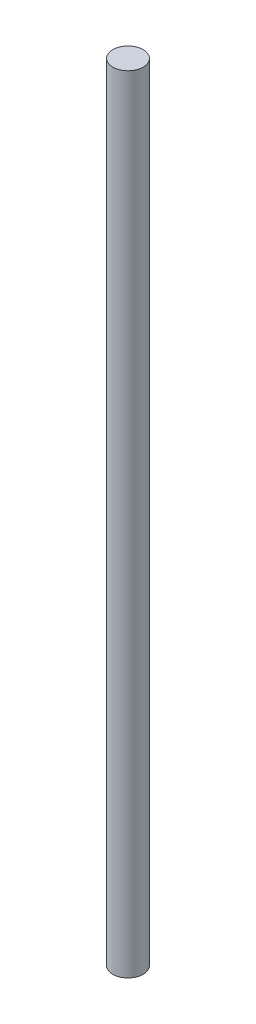
ISO-10303-21;
HEADER;
FILE_DESCRIPTION(('STEP AP214'),'2;1');
FILE_NAME('part.step','',(''),(''),'','','');
FILE_SCHEMA(('AUTOMOTIVE_DESIGN { 1 0 10303 214 1 1 1 1 }'));
ENDSEC;
DATA;
#1=APPLICATION_CONTEXT('core data for automotive mechanical design processes');
#2=APPLICATION_PROTOCOL_DEFINITION('international standard','automotive_design',2000,#1);
#3=PRODUCT_CONTEXT('',#1,'mechanical');
#4=PRODUCT('Part','Part','',(#3));
#5=PRODUCT_RELATED_PRODUCT_CATEGORY('part','',(#4));
#6=PRODUCT_DEFINITION_FORMATION('','',#4);
#7=PRODUCT_DEFINITION_CONTEXT('part definition',#1,'design');
#8=PRODUCT_DEFINITION('design','',#6,#7);
#9=PRODUCT_DEFINITION_SHAPE('','',#8);
#10=(LENGTH_UNIT() NAMED_UNIT(*) SI_UNIT(.MILLI.,.METRE.));
#11=(NAMED_UNIT(*) PLANE_ANGLE_UNIT() SI_UNIT($,.RADIAN.));
#12=(NAMED_UNIT(*) SI_UNIT($,.STERADIAN.) SOLID_ANGLE_UNIT());
#13=UNCERTAINTY_MEASURE_WITH_UNIT(LENGTH_MEASURE(1.E-05),#10,'distance_accuracy_value','');
#14=(GEOMETRIC_REPRESENTATION_CONTEXT(3) GLOBAL_UNCERTAINTY_ASSIGNED_CONTEXT((#13)) GLOBAL_UNIT_ASSIGNED_CONTEXT((#10,
#11,#12)) REPRESENTATION_CONTEXT('',''));
#15=CARTESIAN_POINT('',(0.,0.,0.));
#16=DIRECTION('',(0.,0.,1.));
#17=DIRECTION('',(1.,0.,0.));
#18=AXIS2_PLACEMENT_3D('',#15,#16,#17);
#19=CARTESIAN_POINT('',(10.6802952823821,-109.655613693188,5.86527124349379));
#20=DIRECTION('',(0.,-1.,0.));
#21=DIRECTION('',(-0.48135842784927,0.,0.876523852464084));
#22=AXIS2_PLACEMENT_3D('',#19,#20,#21);
#23=PLANE('',#22);
#24=CARTESIAN_POINT('',(0.,-109.655613693188,0.));
#25=DIRECTION('',(0.,-1.,0.));
#26=DIRECTION('',(0.,0.,-1.));
#27=AXIS2_PLACEMENT_3D('',#24,#25,#26);
#28=CIRCLE('',#27,2.33271488157282);
#29=CARTESIAN_POINT('',(0.,-109.655613693188,-2.33271488157282));
#30=VERTEX_POINT('',#29);
#31=EDGE_CURVE('E10',#30,#30,#28,.F.);
#32=ORIENTED_EDGE('',*,*,#31,.F.);
#33=EDGE_LOOP('',(#32));
#34=FACE_BOUND('',#33,.T.);
#35=ADVANCED_FACE('F32',(#34),#23,.T.);
#36=CARTESIAN_POINT('',(0.,-116.253527738527,0.));
#37=DIRECTION('',(0.,1.,0.));
#38=DIRECTION('',(0.,0.,1.));
#39=AXIS2_PLACEMENT_3D('',#36,#37,#38);
#40=CYLINDRICAL_SURFACE('',#39,2.33271488157282);
#41=ORIENTED_EDGE('',*,*,#31,.T.);
#42=EDGE_LOOP('',(#41));
#43=FACE_BOUND('',#42,.T.);
#44=CARTESIAN_POINT('',(-1.53523027623947E-13,11.0000000000004,4.1286418728248E-13));
#45=DIRECTION('',(0.,-1.,0.));
#46=DIRECTION('',(0.48135842784927,0.,-0.876523852464083));
#47=AXIS2_PLACEMENT_3D('',#44,#45,#46);
#48=CIRCLE('',#47,2.33271488157284);
#49=CARTESIAN_POINT('',(1.12287196801435,11.0000000000004,-2.04468023469611));
#50=VERTEX_POINT('',#49);
#51=EDGE_CURVE('E38',#50,#50,#48,.T.);
#52=ORIENTED_EDGE('',*,*,#51,.T.);
#53=EDGE_LOOP('',(#52));
#54=FACE_BOUND('',#53,.T.);
#55=ADVANCED_FACE('F44',(#43,#54),#40,.T.);
#56=CARTESIAN_POINT('',(-1.53523027623947E-13,11.0000000000004,4.1286418728248E-13));
#57=DIRECTION('',(0.,1.,0.));
#58=DIRECTION('',(0.48135842784927,0.,-0.876523852464083));
#59=AXIS2_PLACEMENT_3D('',#56,#57,#58);
#60=PLANE('',#59);
#61=ORIENTED_EDGE('',*,*,#51,.F.);
#62=EDGE_LOOP('',(#61));
#63=FACE_BOUND('',#62,.T.);
#64=ADVANCED_FACE('F46',(#63),#60,.T.);
#65=CLOSED_SHELL('',(#35,#55,#64));
#66=MANIFOLD_SOLID_BREP('B2',#65);
#67=ADVANCED_BREP_SHAPE_REPRESENTATION('',(#18,#66),#14);
#68=SHAPE_DEFINITION_REPRESENTATION(#9,#67);
ENDSEC;
END-ISO-10303-21;
